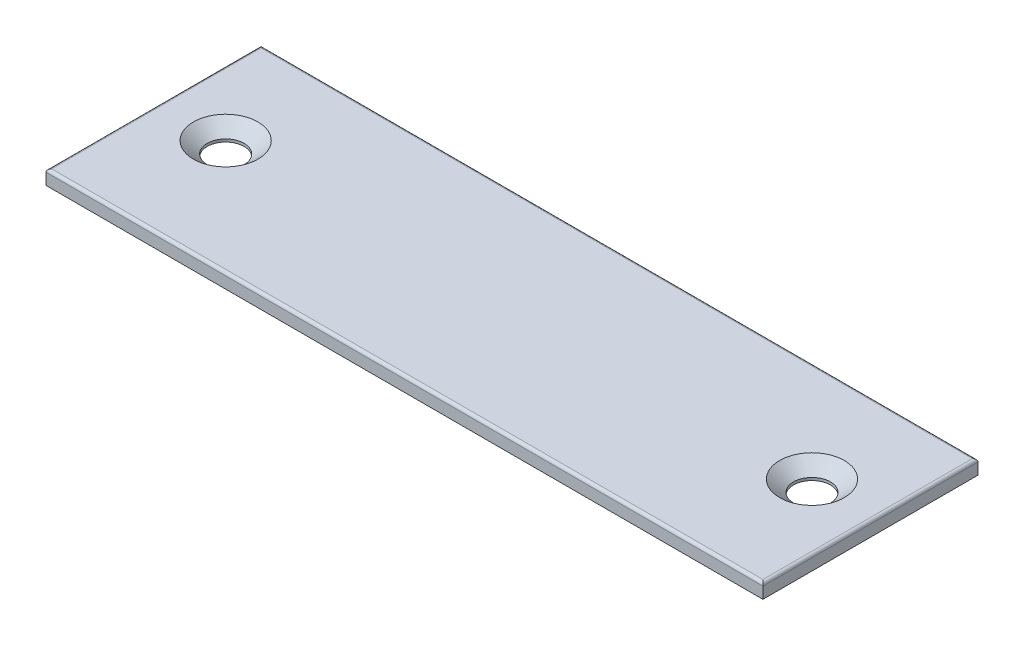
ISO-10303-21;
HEADER;
FILE_DESCRIPTION(('STEP AP214'),'2;1');
FILE_NAME('part.step','',(''),(''),'','','');
FILE_SCHEMA(('AUTOMOTIVE_DESIGN { 1 0 10303 214 1 1 1 1 }'));
ENDSEC;
DATA;
#1=APPLICATION_CONTEXT('core data for automotive mechanical design processes');
#2=APPLICATION_PROTOCOL_DEFINITION('international standard','automotive_design',2000,#1);
#3=PRODUCT_CONTEXT('',#1,'mechanical');
#4=PRODUCT('Part','Part','',(#3));
#5=PRODUCT_RELATED_PRODUCT_CATEGORY('part','',(#4));
#6=PRODUCT_DEFINITION_FORMATION('','',#4);
#7=PRODUCT_DEFINITION_CONTEXT('part definition',#1,'design');
#8=PRODUCT_DEFINITION('design','',#6,#7);
#9=PRODUCT_DEFINITION_SHAPE('','',#8);
#10=(LENGTH_UNIT() NAMED_UNIT(*) SI_UNIT(.MILLI.,.METRE.));
#11=(NAMED_UNIT(*) PLANE_ANGLE_UNIT() SI_UNIT($,.RADIAN.));
#12=(NAMED_UNIT(*) SI_UNIT($,.STERADIAN.) SOLID_ANGLE_UNIT());
#13=UNCERTAINTY_MEASURE_WITH_UNIT(LENGTH_MEASURE(1.E-05),#10,'distance_accuracy_value','');
#14=(GEOMETRIC_REPRESENTATION_CONTEXT(3) GLOBAL_UNCERTAINTY_ASSIGNED_CONTEXT((#13)) GLOBAL_UNIT_ASSIGNED_CONTEXT((#10,
#11,#12)) REPRESENTATION_CONTEXT('',''));
#15=CARTESIAN_POINT('',(0.,0.,0.));
#16=DIRECTION('',(0.,0.,1.));
#17=DIRECTION('',(1.,0.,0.));
#18=AXIS2_PLACEMENT_3D('',#15,#16,#17);
#19=CARTESIAN_POINT('',(31.75,1.27,-11.7999116426902));
#20=DIRECTION('',(-1.,0.,0.));
#21=DIRECTION('',(0.,0.,1.));
#22=AXIS2_PLACEMENT_3D('',#19,#20,#21);
#23=PLANE('',#22);
#24=DIRECTION('',(0.,-1.,0.));
#25=VECTOR('',#24,1.);
#26=CARTESIAN_POINT('',(31.75,1.27,-30.8499116426902));
#27=LINE('',#26,#25);
#28=CARTESIAN_POINT('',(31.75,1.016,-30.8499116426902));
#29=VERTEX_POINT('',#28);
#30=CARTESIAN_POINT('',(31.75,0.,-30.8499116426902));
#31=VERTEX_POINT('',#30);
#32=EDGE_CURVE('E89',#29,#31,#27,.T.);
#33=ORIENTED_EDGE('',*,*,#32,.F.);
#34=DIRECTION('',(0.,0.,-1.));
#35=VECTOR('',#34,1.);
#36=CARTESIAN_POINT('',(31.75,1.016,-11.7999116426902));
#37=LINE('',#36,#35);
#38=CARTESIAN_POINT('',(31.75,1.016,-11.7999116426902));
#39=VERTEX_POINT('',#38);
#40=EDGE_CURVE('E54',#29,#39,#37,.F.);
#41=ORIENTED_EDGE('',*,*,#40,.T.);
#42=DIRECTION('',(0.,-1.,0.));
#43=VECTOR('',#42,1.);
#44=CARTESIAN_POINT('',(31.75,1.27,-11.7999116426902));
#45=LINE('',#44,#43);
#46=CARTESIAN_POINT('',(31.75,0.,-11.7999116426902));
#47=VERTEX_POINT('',#46);
#48=EDGE_CURVE('E107',#39,#47,#45,.T.);
#49=ORIENTED_EDGE('',*,*,#48,.T.);
#50=DIRECTION('',(0.,0.,-1.));
#51=VECTOR('',#50,1.);
#52=CARTESIAN_POINT('',(31.75,0.,-11.7999116426902));
#53=LINE('',#52,#51);
#54=EDGE_CURVE('E102',#47,#31,#53,.T.);
#55=ORIENTED_EDGE('',*,*,#54,.T.);
#56=EDGE_LOOP('',(#33,#41,#49,#55));
#57=FACE_BOUND('',#56,.T.);
#58=ADVANCED_FACE('F37',(#57),#23,.F.);
#59=CARTESIAN_POINT('',(31.75,1.27,-30.8499116426902));
#60=DIRECTION('',(0.,0.,1.));
#61=DIRECTION('',(1.,0.,0.));
#62=AXIS2_PLACEMENT_3D('',#59,#60,#61);
#63=PLANE('',#62);
#64=DIRECTION('',(0.,-1.,0.));
#65=VECTOR('',#64,1.);
#66=CARTESIAN_POINT('',(-31.75,1.27,-30.8499116426901));
#67=LINE('',#66,#65);
#68=CARTESIAN_POINT('',(-31.75,1.016,-30.8499116426901));
#69=VERTEX_POINT('',#68);
#70=CARTESIAN_POINT('',(-31.75,0.,-30.8499116426901));
#71=VERTEX_POINT('',#70);
#72=EDGE_CURVE('E96',#69,#71,#67,.T.);
#73=ORIENTED_EDGE('',*,*,#72,.F.);
#74=DIRECTION('',(-1.,0.,0.));
#75=VECTOR('',#74,1.);
#76=CARTESIAN_POINT('',(31.75,1.016,-30.8499116426902));
#77=LINE('',#76,#75);
#78=EDGE_CURVE('E46',#69,#29,#77,.F.);
#79=ORIENTED_EDGE('',*,*,#78,.T.);
#80=ORIENTED_EDGE('',*,*,#32,.T.);
#81=DIRECTION('',(-1.,0.,0.));
#82=VECTOR('',#81,1.);
#83=CARTESIAN_POINT('',(31.75,0.,-30.8499116426902));
#84=LINE('',#83,#82);
#85=EDGE_CURVE('E92',#31,#71,#84,.T.);
#86=ORIENTED_EDGE('',*,*,#85,.T.);
#87=EDGE_LOOP('',(#73,#79,#80,#86));
#88=FACE_BOUND('',#87,.T.);
#89=ADVANCED_FACE('F91',(#88),#63,.F.);
#90=CARTESIAN_POINT('',(-31.75,1.27,-11.7999116426901));
#91=DIRECTION('',(-1.,0.,0.));
#92=DIRECTION('',(0.,0.,1.));
#93=AXIS2_PLACEMENT_3D('',#90,#91,#92);
#94=PLANE('',#93);
#95=DIRECTION('',(0.,-1.,0.));
#96=VECTOR('',#95,1.);
#97=CARTESIAN_POINT('',(-31.75,1.27,-11.7999116426901));
#98=LINE('',#97,#96);
#99=CARTESIAN_POINT('',(-31.75,1.016,-11.7999116426901));
#100=VERTEX_POINT('',#99);
#101=CARTESIAN_POINT('',(-31.75,0.,-11.7999116426901));
#102=VERTEX_POINT('',#101);
#103=EDGE_CURVE('E119',#100,#102,#98,.T.);
#104=ORIENTED_EDGE('',*,*,#103,.F.);
#105=DIRECTION('',(0.,0.,-1.));
#106=VECTOR('',#105,1.);
#107=CARTESIAN_POINT('',(-31.75,1.016,-11.7999116426901));
#108=LINE('',#107,#106);
#109=EDGE_CURVE('E95',#100,#69,#108,.T.);
#110=ORIENTED_EDGE('',*,*,#109,.T.);
#111=ORIENTED_EDGE('',*,*,#72,.T.);
#112=DIRECTION('',(0.,0.,-1.));
#113=VECTOR('',#112,1.);
#114=CARTESIAN_POINT('',(-31.75,0.,-11.7999116426901));
#115=LINE('',#114,#113);
#116=EDGE_CURVE('E105',#102,#71,#115,.T.);
#117=ORIENTED_EDGE('',*,*,#116,.F.);
#118=EDGE_LOOP('',(#104,#110,#111,#117));
#119=FACE_BOUND('',#118,.T.);
#120=ADVANCED_FACE('F185',(#119),#94,.T.);
#121=CARTESIAN_POINT('',(31.75,1.27,-11.7999116426902));
#122=DIRECTION('',(0.,0.,1.));
#123=DIRECTION('',(1.,0.,0.));
#124=AXIS2_PLACEMENT_3D('',#121,#122,#123);
#125=PLANE('',#124);
#126=ORIENTED_EDGE('',*,*,#48,.F.);
#127=DIRECTION('',(-1.,0.,0.));
#128=VECTOR('',#127,1.);
#129=CARTESIAN_POINT('',(31.75,1.016,-11.7999116426902));
#130=LINE('',#129,#128);
#131=EDGE_CURVE('E11',#39,#100,#130,.T.);
#132=ORIENTED_EDGE('',*,*,#131,.T.);
#133=ORIENTED_EDGE('',*,*,#103,.T.);
#134=DIRECTION('',(-1.,0.,0.));
#135=VECTOR('',#134,1.);
#136=CARTESIAN_POINT('',(31.75,0.,-11.7999116426902));
#137=LINE('',#136,#135);
#138=EDGE_CURVE('E116',#47,#102,#137,.T.);
#139=ORIENTED_EDGE('',*,*,#138,.F.);
#140=EDGE_LOOP('',(#126,#132,#133,#139));
#141=FACE_BOUND('',#140,.T.);
#142=ADVANCED_FACE('F176',(#141),#125,.T.);
#143=CARTESIAN_POINT('',(0.,1.27,0.));
#144=DIRECTION('',(0.,1.,0.));
#145=DIRECTION('',(0.,0.,1.));
#146=AXIS2_PLACEMENT_3D('',#143,#144,#145);
#147=PLANE('',#146);
#148=DIRECTION('',(0.,0.,-1.));
#149=VECTOR('',#148,1.);
#150=CARTESIAN_POINT('',(31.496,1.27,-30.8499116426902));
#151=LINE('',#150,#149);
#152=CARTESIAN_POINT('',(31.496,1.27,-12.0539116426902));
#153=VERTEX_POINT('',#152);
#154=CARTESIAN_POINT('',(31.496,1.27,-30.5959116426902));
#155=VERTEX_POINT('',#154);
#156=EDGE_CURVE('E126',#153,#155,#151,.T.);
#157=ORIENTED_EDGE('',*,*,#156,.T.);
#158=DIRECTION('',(-1.,0.,0.));
#159=VECTOR('',#158,1.);
#160=CARTESIAN_POINT('',(-31.75,1.27,-30.5959116426901));
#161=LINE('',#160,#159);
#162=CARTESIAN_POINT('',(-31.496,1.27,-30.5959116426901));
#163=VERTEX_POINT('',#162);
#164=EDGE_CURVE('E131',#155,#163,#161,.T.);
#165=ORIENTED_EDGE('',*,*,#164,.T.);
#166=DIRECTION('',(0.,0.,-1.));
#167=VECTOR('',#166,1.);
#168=CARTESIAN_POINT('',(-31.496,1.27,0.));
#169=LINE('',#168,#167);
#170=CARTESIAN_POINT('',(-31.496,1.27,-12.0539116426901));
#171=VERTEX_POINT('',#170);
#172=EDGE_CURVE('E128',#163,#171,#169,.F.);
#173=ORIENTED_EDGE('',*,*,#172,.T.);
#174=DIRECTION('',(-1.,0.,0.));
#175=VECTOR('',#174,1.);
#176=CARTESIAN_POINT('',(0.,1.27,-12.0539116426902));
#177=LINE('',#176,#175);
#178=EDGE_CURVE('E124',#171,#153,#177,.F.);
#179=ORIENTED_EDGE('',*,*,#178,.T.);
#180=EDGE_LOOP('',(#157,#165,#173,#179));
#181=FACE_BOUND('',#180,.T.);
#182=CARTESIAN_POINT('',(-25.9662048797982,1.27,-21.9300094733126));
#183=DIRECTION('',(0.,1.,0.));
#184=DIRECTION('',(0.,0.,1.));
#185=AXIS2_PLACEMENT_3D('',#182,#183,#184);
#186=CIRCLE('',#185,2.8575);
#187=CARTESIAN_POINT('',(-25.9662048797982,1.27,-19.0725094733126));
#188=VERTEX_POINT('',#187);
#189=EDGE_CURVE('E144',#188,#188,#186,.T.);
#190=ORIENTED_EDGE('',*,*,#189,.F.);
#191=EDGE_LOOP('',(#190));
#192=FACE_BOUND('',#191,.T.);
#193=CARTESIAN_POINT('',(25.9662048797983,1.27,-21.9300094733126));
#194=DIRECTION('',(0.,1.,0.));
#195=DIRECTION('',(0.,0.,1.));
#196=AXIS2_PLACEMENT_3D('',#193,#194,#195);
#197=CIRCLE('',#196,2.8575);
#198=CARTESIAN_POINT('',(25.9662048797983,1.27,-19.0725094733126));
#199=VERTEX_POINT('',#198);
#200=EDGE_CURVE('E160',#199,#199,#197,.T.);
#201=ORIENTED_EDGE('',*,*,#200,.F.);
#202=EDGE_LOOP('',(#201));
#203=FACE_BOUND('',#202,.T.);
#204=ADVANCED_FACE('F174',(#181,#192,#203),#147,.T.);
#205=CARTESIAN_POINT('',(0.,0.,0.));
#206=DIRECTION('',(0.,1.,0.));
#207=DIRECTION('',(0.,0.,1.));
#208=AXIS2_PLACEMENT_3D('',#205,#206,#207);
#209=PLANE('',#208);
#210=CARTESIAN_POINT('',(-25.9662048797982,0.,-21.9300094733126));
#211=DIRECTION('',(0.,1.,0.));
#212=DIRECTION('',(0.,0.,1.));
#213=AXIS2_PLACEMENT_3D('',#210,#211,#212);
#214=CIRCLE('',#213,1.63195);
#215=CARTESIAN_POINT('',(-25.9662048797982,0.,-20.2980594733126));
#216=VERTEX_POINT('',#215);
#217=EDGE_CURVE('E155',#216,#216,#214,.T.);
#218=ORIENTED_EDGE('',*,*,#217,.T.);
#219=EDGE_LOOP('',(#218));
#220=FACE_BOUND('',#219,.T.);
#221=CARTESIAN_POINT('',(25.9662048797983,0.,-21.9300094733126));
#222=DIRECTION('',(0.,1.,0.));
#223=DIRECTION('',(0.,0.,1.));
#224=AXIS2_PLACEMENT_3D('',#221,#222,#223);
#225=CIRCLE('',#224,1.63195);
#226=CARTESIAN_POINT('',(25.9662048797983,0.,-20.2980594733126));
#227=VERTEX_POINT('',#226);
#228=EDGE_CURVE('E108',#227,#227,#225,.T.);
#229=ORIENTED_EDGE('',*,*,#228,.T.);
#230=EDGE_LOOP('',(#229));
#231=FACE_BOUND('',#230,.T.);
#232=ORIENTED_EDGE('',*,*,#54,.F.);
#233=ORIENTED_EDGE('',*,*,#138,.T.);
#234=ORIENTED_EDGE('',*,*,#116,.T.);
#235=ORIENTED_EDGE('',*,*,#85,.F.);
#236=EDGE_LOOP('',(#232,#233,#234,#235));
#237=FACE_BOUND('',#236,.T.);
#238=ADVANCED_FACE('F100',(#220,#231,#237),#209,.F.);
#239=CARTESIAN_POINT('',(25.9662048797983,1.27,-21.9300094733126));
#240=DIRECTION('',(0.,1.,0.));
#241=DIRECTION('',(0.,0.,1.));
#242=AXIS2_PLACEMENT_3D('',#239,#240,#241);
#243=CYLINDRICAL_SURFACE('',#242,1.63195);
#244=ORIENTED_EDGE('',*,*,#228,.F.);
#245=EDGE_LOOP('',(#244));
#246=FACE_BOUND('',#245,.T.);
#247=CARTESIAN_POINT('',(25.9662048797983,0.241641447010685,-21.9300094733126));
#248=DIRECTION('',(0.,1.,0.));
#249=DIRECTION('',(0.,0.,1.));
#250=AXIS2_PLACEMENT_3D('',#247,#248,#249);
#251=CIRCLE('',#250,1.63195);
#252=CARTESIAN_POINT('',(25.9662048797983,0.241641447010685,-20.2980594733126));
#253=VERTEX_POINT('',#252);
#254=EDGE_CURVE('E111',#253,#253,#251,.T.);
#255=ORIENTED_EDGE('',*,*,#254,.T.);
#256=EDGE_LOOP('',(#255));
#257=FACE_BOUND('',#256,.T.);
#258=ADVANCED_FACE('F165',(#246,#257),#243,.F.);
#259=CARTESIAN_POINT('',(25.9662048797983,1.27,-21.9300094733126));
#260=DIRECTION('',(0.,1.,0.));
#261=DIRECTION('',(0.,0.,1.));
#262=AXIS2_PLACEMENT_3D('',#259,#260,#261);
#263=CONICAL_SURFACE('',#262,2.8575,0.872664625997165);
#264=ORIENTED_EDGE('',*,*,#254,.F.);
#265=EDGE_LOOP('',(#264));
#266=FACE_BOUND('',#265,.T.);
#267=ORIENTED_EDGE('',*,*,#200,.T.);
#268=EDGE_LOOP('',(#267));
#269=FACE_BOUND('',#268,.T.);
#270=ADVANCED_FACE('F167',(#266,#269),#263,.F.);
#271=CARTESIAN_POINT('',(-25.9662048797982,1.27,-21.9300094733126));
#272=DIRECTION('',(0.,1.,0.));
#273=DIRECTION('',(0.,0.,1.));
#274=AXIS2_PLACEMENT_3D('',#271,#272,#273);
#275=CYLINDRICAL_SURFACE('',#274,1.63195);
#276=ORIENTED_EDGE('',*,*,#217,.F.);
#277=EDGE_LOOP('',(#276));
#278=FACE_BOUND('',#277,.T.);
#279=CARTESIAN_POINT('',(-25.9662048797982,0.241641447010685,-21.9300094733126));
#280=DIRECTION('',(0.,1.,0.));
#281=DIRECTION('',(0.,0.,1.));
#282=AXIS2_PLACEMENT_3D('',#279,#280,#281);
#283=CIRCLE('',#282,1.63195);
#284=CARTESIAN_POINT('',(-25.9662048797982,0.241641447010685,-20.2980594733126));
#285=VERTEX_POINT('',#284);
#286=EDGE_CURVE('E150',#285,#285,#283,.T.);
#287=ORIENTED_EDGE('',*,*,#286,.T.);
#288=EDGE_LOOP('',(#287));
#289=FACE_BOUND('',#288,.T.);
#290=ADVANCED_FACE('F170',(#278,#289),#275,.F.);
#291=CARTESIAN_POINT('',(-25.9662048797982,1.27,-21.9300094733126));
#292=DIRECTION('',(0.,1.,0.));
#293=DIRECTION('',(0.,0.,1.));
#294=AXIS2_PLACEMENT_3D('',#291,#292,#293);
#295=CONICAL_SURFACE('',#294,2.8575,0.872664625997165);
#296=ORIENTED_EDGE('',*,*,#286,.F.);
#297=EDGE_LOOP('',(#296));
#298=FACE_BOUND('',#297,.T.);
#299=ORIENTED_EDGE('',*,*,#189,.T.);
#300=EDGE_LOOP('',(#299));
#301=FACE_BOUND('',#300,.T.);
#302=ADVANCED_FACE('F209',(#298,#301),#295,.F.);
#303=CARTESIAN_POINT('',(31.496,1.016,0.));
#304=DIRECTION('',(0.,0.,1.));
#305=DIRECTION('',(1.,0.,0.));
#306=AXIS2_PLACEMENT_3D('',#303,#304,#305);
#307=CYLINDRICAL_SURFACE('',#306,0.254);
#308=CARTESIAN_POINT('',(31.496,1.016,-30.5959116426902));
#309=DIRECTION('',(0.707106781186548,0.,0.707106781186547));
#310=DIRECTION('',(0.707106781186547,0.,-0.707106781186547));
#311=AXIS2_PLACEMENT_3D('',#308,#309,#310);
#312=ELLIPSE('',#311,0.359210244842766,0.254);
#313=EDGE_CURVE('E138',#155,#29,#312,.F.);
#314=ORIENTED_EDGE('',*,*,#313,.F.);
#315=ORIENTED_EDGE('',*,*,#156,.F.);
#316=CARTESIAN_POINT('',(31.496,1.016,-12.0539116426902));
#317=DIRECTION('',(-0.707106781186547,0.,0.707106781186547));
#318=DIRECTION('',(-0.707106781186548,0.,-0.707106781186547));
#319=AXIS2_PLACEMENT_3D('',#316,#317,#318);
#320=ELLIPSE('',#319,0.359210244842766,0.254);
#321=EDGE_CURVE('E41',#39,#153,#320,.T.);
#322=ORIENTED_EDGE('',*,*,#321,.F.);
#323=ORIENTED_EDGE('',*,*,#40,.F.);
#324=EDGE_LOOP('',(#314,#315,#322,#323));
#325=FACE_BOUND('',#324,.T.);
#326=ADVANCED_FACE('F39',(#325),#307,.T.);
#327=CARTESIAN_POINT('',(31.75,1.016,-12.0539116426902));
#328=DIRECTION('',(-1.,0.,0.));
#329=DIRECTION('',(0.,0.,1.));
#330=AXIS2_PLACEMENT_3D('',#327,#328,#329);
#331=CYLINDRICAL_SURFACE('',#330,0.254);
#332=ORIENTED_EDGE('',*,*,#321,.T.);
#333=ORIENTED_EDGE('',*,*,#178,.F.);
#334=CARTESIAN_POINT('',(-31.496,1.016,-12.0539116426901));
#335=DIRECTION('',(-0.707106781186548,0.,-0.707106781186547));
#336=DIRECTION('',(-0.707106781186547,0.,0.707106781186547));
#337=AXIS2_PLACEMENT_3D('',#334,#335,#336);
#338=ELLIPSE('',#337,0.359210244842766,0.254);
#339=EDGE_CURVE('E137',#100,#171,#338,.T.);
#340=ORIENTED_EDGE('',*,*,#339,.F.);
#341=ORIENTED_EDGE('',*,*,#131,.F.);
#342=EDGE_LOOP('',(#332,#333,#340,#341));
#343=FACE_BOUND('',#342,.T.);
#344=ADVANCED_FACE('F204',(#343),#331,.T.);
#345=CARTESIAN_POINT('',(0.,1.016,-30.5959116426902));
#346=DIRECTION('',(1.,0.,0.));
#347=DIRECTION('',(0.,0.,-1.));
#348=AXIS2_PLACEMENT_3D('',#345,#346,#347);
#349=CYLINDRICAL_SURFACE('',#348,0.254);
#350=ORIENTED_EDGE('',*,*,#313,.T.);
#351=ORIENTED_EDGE('',*,*,#78,.F.);
#352=CARTESIAN_POINT('',(-31.496,1.016,-30.5959116426901));
#353=DIRECTION('',(0.707106781186547,0.,-0.707106781186547));
#354=DIRECTION('',(0.707106781186548,0.,0.707106781186547));
#355=AXIS2_PLACEMENT_3D('',#352,#353,#354);
#356=ELLIPSE('',#355,0.359210244842766,0.254);
#357=EDGE_CURVE('E135',#163,#69,#356,.F.);
#358=ORIENTED_EDGE('',*,*,#357,.F.);
#359=ORIENTED_EDGE('',*,*,#164,.F.);
#360=EDGE_LOOP('',(#350,#351,#358,#359));
#361=FACE_BOUND('',#360,.T.);
#362=ADVANCED_FACE('F201',(#361),#349,.T.);
#363=CARTESIAN_POINT('',(-31.496,1.016,-11.7999116426901));
#364=DIRECTION('',(0.,0.,-1.));
#365=DIRECTION('',(-1.,0.,0.));
#366=AXIS2_PLACEMENT_3D('',#363,#364,#365);
#367=CYLINDRICAL_SURFACE('',#366,0.254);
#368=ORIENTED_EDGE('',*,*,#339,.T.);
#369=ORIENTED_EDGE('',*,*,#172,.F.);
#370=ORIENTED_EDGE('',*,*,#357,.T.);
#371=ORIENTED_EDGE('',*,*,#109,.F.);
#372=EDGE_LOOP('',(#368,#369,#370,#371));
#373=FACE_BOUND('',#372,.T.);
#374=ADVANCED_FACE('F198',(#373),#367,.T.);
#375=CLOSED_SHELL('',(#58,#89,#120,#142,#204,#238,#258,#270,#290,#302,#326,#344,#362,#374));
#376=MANIFOLD_SOLID_BREP('B2',#375);
#377=ADVANCED_BREP_SHAPE_REPRESENTATION('',(#18,#376),#14);
#378=SHAPE_DEFINITION_REPRESENTATION(#9,#377);
ENDSEC;
END-ISO-10303-21;
